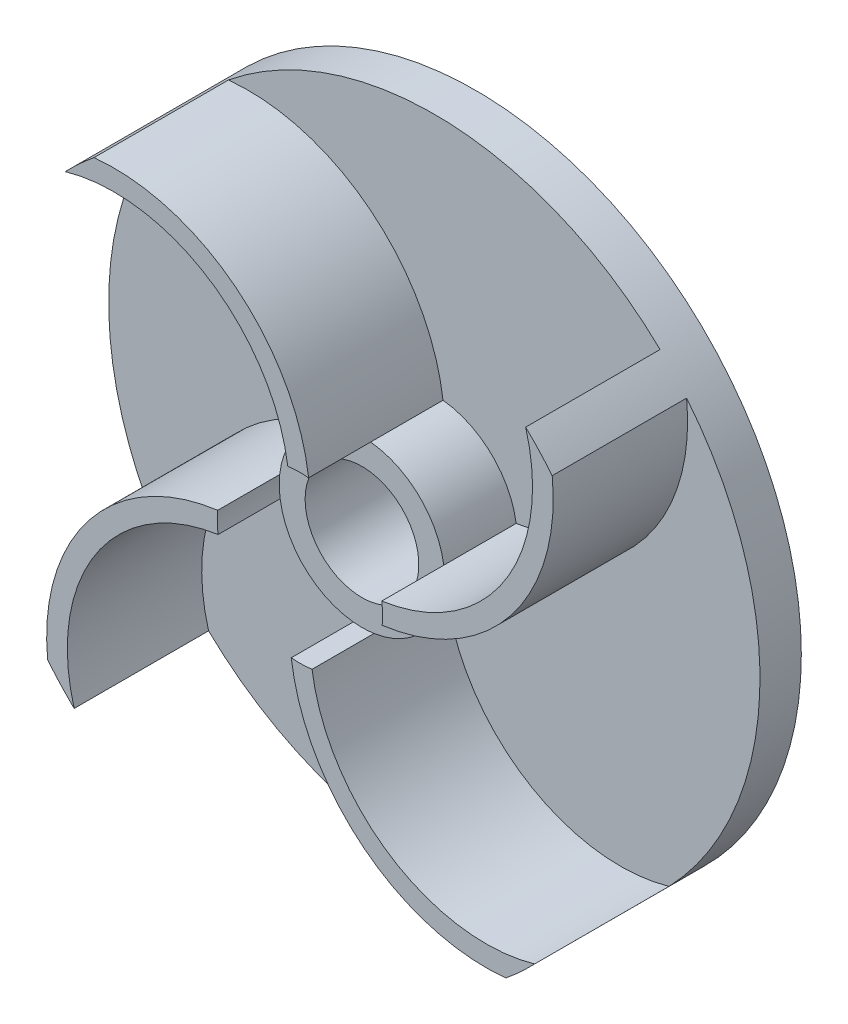
ISO-10303-21;
HEADER;
FILE_DESCRIPTION(('STEP AP214'),'2;1');
FILE_NAME('part.step','',(''),(''),'','','');
FILE_SCHEMA(('AUTOMOTIVE_DESIGN { 1 0 10303 214 1 1 1 1 }'));
ENDSEC;
DATA;
#1=APPLICATION_CONTEXT('core data for automotive mechanical design processes');
#2=APPLICATION_PROTOCOL_DEFINITION('international standard','automotive_design',2000,#1);
#3=PRODUCT_CONTEXT('',#1,'mechanical');
#4=PRODUCT('Part','Part','',(#3));
#5=PRODUCT_RELATED_PRODUCT_CATEGORY('part','',(#4));
#6=PRODUCT_DEFINITION_FORMATION('','',#4);
#7=PRODUCT_DEFINITION_CONTEXT('part definition',#1,'design');
#8=PRODUCT_DEFINITION('design','',#6,#7);
#9=PRODUCT_DEFINITION_SHAPE('','',#8);
#10=(LENGTH_UNIT() NAMED_UNIT(*) SI_UNIT(.MILLI.,.METRE.));
#11=(NAMED_UNIT(*) PLANE_ANGLE_UNIT() SI_UNIT($,.RADIAN.));
#12=(NAMED_UNIT(*) SI_UNIT($,.STERADIAN.) SOLID_ANGLE_UNIT());
#13=UNCERTAINTY_MEASURE_WITH_UNIT(LENGTH_MEASURE(1.E-05),#10,'distance_accuracy_value','');
#14=(GEOMETRIC_REPRESENTATION_CONTEXT(3) GLOBAL_UNCERTAINTY_ASSIGNED_CONTEXT((#13)) GLOBAL_UNIT_ASSIGNED_CONTEXT((#10,
#11,#12)) REPRESENTATION_CONTEXT('',''));
#15=CARTESIAN_POINT('',(0.,0.,0.));
#16=DIRECTION('',(0.,0.,1.));
#17=DIRECTION('',(1.,0.,0.));
#18=AXIS2_PLACEMENT_3D('',#15,#16,#17);
#19=CARTESIAN_POINT('',(0.,0.,4.));
#20=DIRECTION('',(0.,0.,1.));
#21=DIRECTION('',(1.,0.,0.));
#22=AXIS2_PLACEMENT_3D('',#19,#20,#21);
#23=PLANE('',#22);
#24=CARTESIAN_POINT('',(-18.,5.49999999999994,4.));
#25=DIRECTION('',(0.,0.,1.));
#26=DIRECTION('',(0.,1.,0.));
#27=AXIS2_PLACEMENT_3D('',#24,#25,#26);
#28=CIRCLE('',#27,19.);
#29=CARTESIAN_POINT('',(0.840633862767083,7.95571082360145,4.));
#30=VERTEX_POINT('',#29);
#31=CARTESIAN_POINT('',(-19.9185624578197,24.4028865016812,4.));
#32=VERTEX_POINT('',#31);
#33=EDGE_CURVE('E235',#30,#32,#28,.T.);
#34=ORIENTED_EDGE('',*,*,#33,.F.);
#35=CARTESIAN_POINT('',(0.,0.,4.));
#36=DIRECTION('',(0.,0.,1.));
#37=DIRECTION('',(1.,0.,0.));
#38=AXIS2_PLACEMENT_3D('',#35,#36,#37);
#39=CIRCLE('',#38,8.);
#40=CARTESIAN_POINT('',(7.91365321010498,1.17221707469014,4.));
#41=VERTEX_POINT('',#40);
#42=EDGE_CURVE('E352',#41,#30,#39,.T.);
#43=ORIENTED_EDGE('',*,*,#42,.F.);
#44=CARTESIAN_POINT('',(5.5,18.,4.));
#45=DIRECTION('',(0.,0.,-1.));
#46=DIRECTION('',(1.,0.,0.));
#47=AXIS2_PLACEMENT_3D('',#44,#45,#46);
#48=CIRCLE('',#47,17.);
#49=CARTESIAN_POINT('',(21.8366020435947,22.7027049311238,4.));
#50=VERTEX_POINT('',#49);
#51=EDGE_CURVE('E193',#50,#41,#48,.T.);
#52=ORIENTED_EDGE('',*,*,#51,.F.);
#53=CARTESIAN_POINT('',(0.,0.,4.));
#54=DIRECTION('',(0.,0.,1.));
#55=DIRECTION('',(1.,0.,0.));
#56=AXIS2_PLACEMENT_3D('',#53,#54,#55);
#57=CIRCLE('',#56,31.5);
#58=EDGE_CURVE('E267',#50,#32,#57,.T.);
#59=ORIENTED_EDGE('',*,*,#58,.T.);
#60=EDGE_LOOP('',(#34,#43,#52,#59));
#61=FACE_BOUND('',#60,.T.);
#62=ADVANCED_FACE('F27',(#61),#23,.T.);
#63=CARTESIAN_POINT('',(-5.49999999999987,-18.,4.));
#64=DIRECTION('',(0.,0.,1.));
#65=DIRECTION('',(-1.,0.,0.));
#66=AXIS2_PLACEMENT_3D('',#63,#64,#65);
#67=CIRCLE('',#66,19.);
#68=CARTESIAN_POINT('',(-7.95571082360146,0.840633862767053,4.));
#69=VERTEX_POINT('',#68);
#70=CARTESIAN_POINT('',(-24.4028865016812,-19.9185624578198,4.));
#71=VERTEX_POINT('',#70);
#72=EDGE_CURVE('E217',#69,#71,#67,.T.);
#73=ORIENTED_EDGE('',*,*,#72,.F.);
#74=CARTESIAN_POINT('',(-1.17221707469017,7.91365321010498,4.));
#75=VERTEX_POINT('',#74);
#76=EDGE_CURVE('E353',#75,#69,#39,.T.);
#77=ORIENTED_EDGE('',*,*,#76,.F.);
#78=CARTESIAN_POINT('',(-18.,5.49999999999994,4.));
#79=DIRECTION('',(0.,0.,-1.));
#80=DIRECTION('',(0.,1.,0.));
#81=AXIS2_PLACEMENT_3D('',#78,#79,#80);
#82=CIRCLE('',#81,17.);
#83=CARTESIAN_POINT('',(-22.7027049311239,21.8366020435946,4.));
#84=VERTEX_POINT('',#83);
#85=EDGE_CURVE('E237',#84,#75,#82,.T.);
#86=ORIENTED_EDGE('',*,*,#85,.F.);
#87=EDGE_CURVE('E274',#84,#71,#57,.T.);
#88=ORIENTED_EDGE('',*,*,#87,.T.);
#89=EDGE_LOOP('',(#73,#77,#86,#88));
#90=FACE_BOUND('',#89,.T.);
#91=ADVANCED_FACE('F294',(#90),#23,.T.);
#92=CARTESIAN_POINT('',(18.0000000000001,-5.49999999999981,4.));
#93=DIRECTION('',(0.,0.,1.));
#94=DIRECTION('',(0.,-1.,0.));
#95=AXIS2_PLACEMENT_3D('',#92,#93,#94);
#96=CIRCLE('',#95,19.);
#97=CARTESIAN_POINT('',(-0.840633862767022,-7.95571082360146,4.));
#98=VERTEX_POINT('',#97);
#99=CARTESIAN_POINT('',(19.9185624578199,-24.4028865016811,4.));
#100=VERTEX_POINT('',#99);
#101=EDGE_CURVE('E199',#98,#100,#96,.T.);
#102=ORIENTED_EDGE('',*,*,#101,.F.);
#103=CARTESIAN_POINT('',(-7.91365321010497,-1.1722170746902,4.));
#104=VERTEX_POINT('',#103);
#105=EDGE_CURVE('E357',#104,#98,#39,.T.);
#106=ORIENTED_EDGE('',*,*,#105,.F.);
#107=CARTESIAN_POINT('',(-5.49999999999987,-18.,4.));
#108=DIRECTION('',(0.,0.,-1.));
#109=DIRECTION('',(-1.,0.,0.));
#110=AXIS2_PLACEMENT_3D('',#107,#108,#109);
#111=CIRCLE('',#110,17.);
#112=CARTESIAN_POINT('',(-21.8366020435946,-22.702704931124,4.));
#113=VERTEX_POINT('',#112);
#114=EDGE_CURVE('E219',#113,#104,#111,.T.);
#115=ORIENTED_EDGE('',*,*,#114,.F.);
#116=EDGE_CURVE('E277',#113,#100,#57,.T.);
#117=ORIENTED_EDGE('',*,*,#116,.T.);
#118=EDGE_LOOP('',(#102,#106,#115,#117));
#119=FACE_BOUND('',#118,.T.);
#120=ADVANCED_FACE('F385',(#119),#23,.T.);
#121=CARTESIAN_POINT('',(5.5,18.,4.));
#122=DIRECTION('',(0.,0.,1.));
#123=DIRECTION('',(1.,0.,0.));
#124=AXIS2_PLACEMENT_3D('',#121,#122,#123);
#125=CIRCLE('',#124,19.);
#126=CARTESIAN_POINT('',(7.95571082360145,-0.840633862767114,4.));
#127=VERTEX_POINT('',#126);
#128=CARTESIAN_POINT('',(24.4028865016813,19.9185624578196,4.));
#129=VERTEX_POINT('',#128);
#130=EDGE_CURVE('E31',#127,#129,#125,.T.);
#131=ORIENTED_EDGE('',*,*,#130,.F.);
#132=CARTESIAN_POINT('',(1.17221707469023,-7.91365321010497,4.));
#133=VERTEX_POINT('',#132);
#134=EDGE_CURVE('E355',#133,#127,#39,.T.);
#135=ORIENTED_EDGE('',*,*,#134,.F.);
#136=CARTESIAN_POINT('',(18.0000000000001,-5.49999999999981,4.));
#137=DIRECTION('',(0.,0.,-1.));
#138=DIRECTION('',(0.,-1.,0.));
#139=AXIS2_PLACEMENT_3D('',#136,#137,#138);
#140=CIRCLE('',#139,17.);
#141=CARTESIAN_POINT('',(22.7027049311241,-21.8366020435945,4.));
#142=VERTEX_POINT('',#141);
#143=EDGE_CURVE('E201',#142,#133,#140,.T.);
#144=ORIENTED_EDGE('',*,*,#143,.F.);
#145=EDGE_CURVE('E263',#142,#129,#57,.T.);
#146=ORIENTED_EDGE('',*,*,#145,.T.);
#147=EDGE_LOOP('',(#131,#135,#144,#146));
#148=FACE_BOUND('',#147,.T.);
#149=ADVANCED_FACE('F380',(#148),#23,.T.);
#150=CARTESIAN_POINT('',(5.5,18.,17.));
#151=DIRECTION('',(0.,0.,-1.));
#152=DIRECTION('',(-1.,0.,0.));
#153=AXIS2_PLACEMENT_3D('',#150,#151,#152);
#154=CYLINDRICAL_SURFACE('',#153,19.);
#155=DIRECTION('',(0.,0.,1.));
#156=VECTOR('',#155,1.);
#157=CARTESIAN_POINT('',(7.95571082360145,-0.840633862767115,13.5));
#158=LINE('',#157,#156);
#159=CARTESIAN_POINT('',(7.95571082360145,-0.840633862767115,11.));
#160=VERTEX_POINT('',#159);
#161=EDGE_CURVE('E194',#160,#127,#158,.F.);
#162=ORIENTED_EDGE('',*,*,#161,.T.);
#163=ORIENTED_EDGE('',*,*,#130,.T.);
#164=DIRECTION('',(0.,0.,-1.));
#165=VECTOR('',#164,1.);
#166=CARTESIAN_POINT('',(24.4028865016813,19.9185624578196,17.));
#167=LINE('',#166,#165);
#168=CARTESIAN_POINT('',(24.4028865016813,19.9185624578196,17.));
#169=VERTEX_POINT('',#168);
#170=EDGE_CURVE('E264',#169,#129,#167,.T.);
#171=ORIENTED_EDGE('',*,*,#170,.F.);
#172=CARTESIAN_POINT('',(5.5,18.,17.));
#173=DIRECTION('',(0.,0.,1.));
#174=DIRECTION('',(1.,0.,0.));
#175=AXIS2_PLACEMENT_3D('',#172,#173,#174);
#176=CIRCLE('',#175,19.);
#177=CARTESIAN_POINT('',(7.95571082360145,-0.840633862767115,17.));
#178=VERTEX_POINT('',#177);
#179=EDGE_CURVE('E253',#178,#169,#176,.T.);
#180=ORIENTED_EDGE('',*,*,#179,.F.);
#181=EDGE_CURVE('E51',#178,#160,#158,.F.);
#182=ORIENTED_EDGE('',*,*,#181,.T.);
#183=EDGE_LOOP('',(#162,#163,#171,#180,#182));
#184=FACE_BOUND('',#183,.T.);
#185=ADVANCED_FACE('F388',(#184),#154,.T.);
#186=CARTESIAN_POINT('',(5.5,18.,17.));
#187=DIRECTION('',(0.,0.,-1.));
#188=DIRECTION('',(-1.,0.,0.));
#189=AXIS2_PLACEMENT_3D('',#186,#187,#188);
#190=CYLINDRICAL_SURFACE('',#189,17.);
#191=ORIENTED_EDGE('',*,*,#51,.T.);
#192=DIRECTION('',(0.,0.,1.));
#193=VECTOR('',#192,1.);
#194=CARTESIAN_POINT('',(7.91365321010498,1.17221707469014,13.5));
#195=LINE('',#194,#193);
#196=CARTESIAN_POINT('',(7.91365321010498,1.17221707469014,11.));
#197=VERTEX_POINT('',#196);
#198=EDGE_CURVE('E175',#41,#197,#195,.T.);
#199=ORIENTED_EDGE('',*,*,#198,.T.);
#200=CARTESIAN_POINT('',(7.91365321010498,1.17221707469014,17.));
#201=VERTEX_POINT('',#200);
#202=EDGE_CURVE('E182',#197,#201,#195,.T.);
#203=ORIENTED_EDGE('',*,*,#202,.T.);
#204=CARTESIAN_POINT('',(5.5,18.,17.));
#205=DIRECTION('',(0.,0.,-1.));
#206=DIRECTION('',(1.,0.,0.));
#207=AXIS2_PLACEMENT_3D('',#204,#205,#206);
#208=CIRCLE('',#207,17.);
#209=CARTESIAN_POINT('',(21.8366020435947,22.7027049311238,17.));
#210=VERTEX_POINT('',#209);
#211=EDGE_CURVE('E257',#210,#201,#208,.T.);
#212=ORIENTED_EDGE('',*,*,#211,.F.);
#213=DIRECTION('',(0.,0.,-1.));
#214=VECTOR('',#213,1.);
#215=CARTESIAN_POINT('',(21.8366020435947,22.7027049311238,17.));
#216=LINE('',#215,#214);
#217=EDGE_CURVE('E259',#210,#50,#216,.T.);
#218=ORIENTED_EDGE('',*,*,#217,.T.);
#219=EDGE_LOOP('',(#191,#199,#203,#212,#218));
#220=FACE_BOUND('',#219,.T.);
#221=ADVANCED_FACE('F191',(#220),#190,.F.);
#222=CARTESIAN_POINT('',(-18.,5.49999999999994,17.));
#223=DIRECTION('',(0.,0.,-1.));
#224=DIRECTION('',(-1.,0.,0.));
#225=AXIS2_PLACEMENT_3D('',#222,#223,#224);
#226=CYLINDRICAL_SURFACE('',#225,19.);
#227=DIRECTION('',(0.,0.,-1.));
#228=VECTOR('',#227,1.);
#229=CARTESIAN_POINT('',(0.840633862767084,7.95571082360145,7.5));
#230=LINE('',#229,#228);
#231=CARTESIAN_POINT('',(0.840633862767082,7.95571082360145,11.));
#232=VERTEX_POINT('',#231);
#233=EDGE_CURVE('E178',#30,#232,#230,.F.);
#234=ORIENTED_EDGE('',*,*,#233,.F.);
#235=ORIENTED_EDGE('',*,*,#33,.T.);
#236=DIRECTION('',(0.,0.,-1.));
#237=VECTOR('',#236,1.);
#238=CARTESIAN_POINT('',(-19.9185624578197,24.4028865016812,17.));
#239=LINE('',#238,#237);
#240=CARTESIAN_POINT('',(-19.9185624578197,24.4028865016812,17.));
#241=VERTEX_POINT('',#240);
#242=EDGE_CURVE('E249',#241,#32,#239,.T.);
#243=ORIENTED_EDGE('',*,*,#242,.F.);
#244=CARTESIAN_POINT('',(-18.,5.49999999999994,17.));
#245=DIRECTION('',(0.,0.,1.));
#246=DIRECTION('',(0.,1.,0.));
#247=AXIS2_PLACEMENT_3D('',#244,#245,#246);
#248=CIRCLE('',#247,19.);
#249=CARTESIAN_POINT('',(0.840633862767084,7.95571082360146,17.));
#250=VERTEX_POINT('',#249);
#251=EDGE_CURVE('E240',#250,#241,#248,.T.);
#252=ORIENTED_EDGE('',*,*,#251,.F.);
#253=DIRECTION('',(0.,0.,1.));
#254=VECTOR('',#253,1.);
#255=CARTESIAN_POINT('',(0.840633862767084,7.95571082360145,13.5));
#256=LINE('',#255,#254);
#257=EDGE_CURVE('E188',#250,#232,#256,.F.);
#258=ORIENTED_EDGE('',*,*,#257,.T.);
#259=EDGE_LOOP('',(#234,#235,#243,#252,#258));
#260=FACE_BOUND('',#259,.T.);
#261=ADVANCED_FACE('F351',(#260),#226,.T.);
#262=CARTESIAN_POINT('',(-18.,5.49999999999994,17.));
#263=DIRECTION('',(0.,0.,-1.));
#264=DIRECTION('',(-1.,0.,0.));
#265=AXIS2_PLACEMENT_3D('',#262,#263,#264);
#266=CYLINDRICAL_SURFACE('',#265,17.);
#267=ORIENTED_EDGE('',*,*,#85,.T.);
#268=DIRECTION('',(0.,0.,1.));
#269=VECTOR('',#268,1.);
#270=CARTESIAN_POINT('',(-1.17221707469017,7.91365321010498,13.5));
#271=LINE('',#270,#269);
#272=CARTESIAN_POINT('',(-1.17221707469017,7.91365321010498,11.));
#273=VERTEX_POINT('',#272);
#274=EDGE_CURVE('E333',#75,#273,#271,.T.);
#275=ORIENTED_EDGE('',*,*,#274,.T.);
#276=CARTESIAN_POINT('',(-1.17221707469017,7.91365321010498,17.));
#277=VERTEX_POINT('',#276);
#278=EDGE_CURVE('E332',#273,#277,#271,.T.);
#279=ORIENTED_EDGE('',*,*,#278,.T.);
#280=CARTESIAN_POINT('',(-18.,5.49999999999994,17.));
#281=DIRECTION('',(0.,0.,-1.));
#282=DIRECTION('',(0.,1.,0.));
#283=AXIS2_PLACEMENT_3D('',#280,#281,#282);
#284=CIRCLE('',#283,17.);
#285=CARTESIAN_POINT('',(-22.7027049311239,21.8366020435946,17.));
#286=VERTEX_POINT('',#285);
#287=EDGE_CURVE('E244',#286,#277,#284,.T.);
#288=ORIENTED_EDGE('',*,*,#287,.F.);
#289=DIRECTION('',(0.,0.,-1.));
#290=VECTOR('',#289,1.);
#291=CARTESIAN_POINT('',(-22.7027049311239,21.8366020435946,17.));
#292=LINE('',#291,#290);
#293=EDGE_CURVE('E247',#286,#84,#292,.T.);
#294=ORIENTED_EDGE('',*,*,#293,.T.);
#295=EDGE_LOOP('',(#267,#275,#279,#288,#294));
#296=FACE_BOUND('',#295,.T.);
#297=ADVANCED_FACE('F340',(#296),#266,.F.);
#298=CARTESIAN_POINT('',(-5.49999999999987,-18.,17.));
#299=DIRECTION('',(0.,0.,-1.));
#300=DIRECTION('',(-1.,0.,0.));
#301=AXIS2_PLACEMENT_3D('',#298,#299,#300);
#302=CYLINDRICAL_SURFACE('',#301,19.);
#303=DIRECTION('',(0.,0.,-1.));
#304=VECTOR('',#303,1.);
#305=CARTESIAN_POINT('',(-7.95571082360146,0.840633862767053,7.5));
#306=LINE('',#305,#304);
#307=CARTESIAN_POINT('',(-7.95571082360146,0.840633862767054,11.));
#308=VERTEX_POINT('',#307);
#309=EDGE_CURVE('E307',#69,#308,#306,.F.);
#310=ORIENTED_EDGE('',*,*,#309,.F.);
#311=ORIENTED_EDGE('',*,*,#72,.T.);
#312=DIRECTION('',(0.,0.,-1.));
#313=VECTOR('',#312,1.);
#314=CARTESIAN_POINT('',(-24.4028865016812,-19.9185624578198,17.));
#315=LINE('',#314,#313);
#316=CARTESIAN_POINT('',(-24.4028865016812,-19.9185624578198,17.));
#317=VERTEX_POINT('',#316);
#318=EDGE_CURVE('E232',#317,#71,#315,.T.);
#319=ORIENTED_EDGE('',*,*,#318,.F.);
#320=CARTESIAN_POINT('',(-5.49999999999987,-18.,17.));
#321=DIRECTION('',(0.,0.,1.));
#322=DIRECTION('',(-1.,0.,0.));
#323=AXIS2_PLACEMENT_3D('',#320,#321,#322);
#324=CIRCLE('',#323,19.);
#325=CARTESIAN_POINT('',(-7.95571082360146,0.840633862767053,17.));
#326=VERTEX_POINT('',#325);
#327=EDGE_CURVE('E222',#326,#317,#324,.T.);
#328=ORIENTED_EDGE('',*,*,#327,.F.);
#329=DIRECTION('',(0.,0.,1.));
#330=VECTOR('',#329,1.);
#331=CARTESIAN_POINT('',(-7.95571082360146,0.840633862767053,13.5));
#332=LINE('',#331,#330);
#333=EDGE_CURVE('E308',#326,#308,#332,.F.);
#334=ORIENTED_EDGE('',*,*,#333,.T.);
#335=EDGE_LOOP('',(#310,#311,#319,#328,#334));
#336=FACE_BOUND('',#335,.T.);
#337=ADVANCED_FACE('F305',(#336),#302,.T.);
#338=CARTESIAN_POINT('',(-5.49999999999987,-18.,17.));
#339=DIRECTION('',(0.,0.,-1.));
#340=DIRECTION('',(-1.,0.,0.));
#341=AXIS2_PLACEMENT_3D('',#338,#339,#340);
#342=CYLINDRICAL_SURFACE('',#341,17.);
#343=ORIENTED_EDGE('',*,*,#114,.T.);
#344=DIRECTION('',(0.,0.,1.));
#345=VECTOR('',#344,1.);
#346=CARTESIAN_POINT('',(-7.91365321010497,-1.1722170746902,13.5));
#347=LINE('',#346,#345);
#348=CARTESIAN_POINT('',(-7.91365321010497,-1.1722170746902,11.));
#349=VERTEX_POINT('',#348);
#350=EDGE_CURVE('E329',#104,#349,#347,.T.);
#351=ORIENTED_EDGE('',*,*,#350,.T.);
#352=CARTESIAN_POINT('',(-7.91365321010497,-1.1722170746902,17.));
#353=VERTEX_POINT('',#352);
#354=EDGE_CURVE('E328',#349,#353,#347,.T.);
#355=ORIENTED_EDGE('',*,*,#354,.T.);
#356=CARTESIAN_POINT('',(-5.49999999999987,-18.,17.));
#357=DIRECTION('',(0.,0.,-1.));
#358=DIRECTION('',(-1.,0.,0.));
#359=AXIS2_PLACEMENT_3D('',#356,#357,#358);
#360=CIRCLE('',#359,17.);
#361=CARTESIAN_POINT('',(-21.8366020435946,-22.702704931124,17.));
#362=VERTEX_POINT('',#361);
#363=EDGE_CURVE('E226',#362,#353,#360,.T.);
#364=ORIENTED_EDGE('',*,*,#363,.F.);
#365=DIRECTION('',(0.,0.,-1.));
#366=VECTOR('',#365,1.);
#367=CARTESIAN_POINT('',(-21.8366020435946,-22.702704931124,17.));
#368=LINE('',#367,#366);
#369=EDGE_CURVE('E229',#362,#113,#368,.T.);
#370=ORIENTED_EDGE('',*,*,#369,.T.);
#371=EDGE_LOOP('',(#343,#351,#355,#364,#370));
#372=FACE_BOUND('',#371,.T.);
#373=ADVANCED_FACE('F435',(#372),#342,.F.);
#374=CARTESIAN_POINT('',(18.0000000000001,-5.49999999999981,17.));
#375=DIRECTION('',(0.,0.,-1.));
#376=DIRECTION('',(-1.,0.,0.));
#377=AXIS2_PLACEMENT_3D('',#374,#375,#376);
#378=CYLINDRICAL_SURFACE('',#377,19.);
#379=DIRECTION('',(0.,0.,-1.));
#380=VECTOR('',#379,1.);
#381=CARTESIAN_POINT('',(-0.840633862767025,-7.95571082360146,7.5));
#382=LINE('',#381,#380);
#383=CARTESIAN_POINT('',(-0.840633862767025,-7.95571082360146,11.));
#384=VERTEX_POINT('',#383);
#385=EDGE_CURVE('E179',#98,#384,#382,.F.);
#386=ORIENTED_EDGE('',*,*,#385,.F.);
#387=ORIENTED_EDGE('',*,*,#101,.T.);
#388=DIRECTION('',(0.,0.,-1.));
#389=VECTOR('',#388,1.);
#390=CARTESIAN_POINT('',(19.9185624578199,-24.4028865016811,17.));
#391=LINE('',#390,#389);
#392=CARTESIAN_POINT('',(19.9185624578199,-24.4028865016811,17.));
#393=VERTEX_POINT('',#392);
#394=EDGE_CURVE('E214',#393,#100,#391,.T.);
#395=ORIENTED_EDGE('',*,*,#394,.F.);
#396=CARTESIAN_POINT('',(18.0000000000001,-5.49999999999981,17.));
#397=DIRECTION('',(0.,0.,1.));
#398=DIRECTION('',(0.,-1.,0.));
#399=AXIS2_PLACEMENT_3D('',#396,#397,#398);
#400=CIRCLE('',#399,19.);
#401=CARTESIAN_POINT('',(-0.840633862767025,-7.95571082360146,17.));
#402=VERTEX_POINT('',#401);
#403=EDGE_CURVE('E204',#402,#393,#400,.T.);
#404=ORIENTED_EDGE('',*,*,#403,.F.);
#405=DIRECTION('',(0.,0.,1.));
#406=VECTOR('',#405,1.);
#407=CARTESIAN_POINT('',(-0.840633862767025,-7.95571082360146,13.5));
#408=LINE('',#407,#406);
#409=EDGE_CURVE('E324',#402,#384,#408,.F.);
#410=ORIENTED_EDGE('',*,*,#409,.T.);
#411=EDGE_LOOP('',(#386,#387,#395,#404,#410));
#412=FACE_BOUND('',#411,.T.);
#413=ADVANCED_FACE('F440',(#412),#378,.T.);
#414=CARTESIAN_POINT('',(18.0000000000001,-5.49999999999981,17.));
#415=DIRECTION('',(0.,0.,-1.));
#416=DIRECTION('',(-1.,0.,0.));
#417=AXIS2_PLACEMENT_3D('',#414,#415,#416);
#418=CYLINDRICAL_SURFACE('',#417,17.);
#419=ORIENTED_EDGE('',*,*,#143,.T.);
#420=DIRECTION('',(0.,0.,1.));
#421=VECTOR('',#420,1.);
#422=CARTESIAN_POINT('',(1.17221707469023,-7.91365321010497,13.5));
#423=LINE('',#422,#421);
#424=CARTESIAN_POINT('',(1.17221707469023,-7.91365321010497,11.));
#425=VERTEX_POINT('',#424);
#426=EDGE_CURVE('E321',#133,#425,#423,.T.);
#427=ORIENTED_EDGE('',*,*,#426,.T.);
#428=CARTESIAN_POINT('',(1.17221707469023,-7.91365321010497,17.));
#429=VERTEX_POINT('',#428);
#430=EDGE_CURVE('E325',#425,#429,#423,.T.);
#431=ORIENTED_EDGE('',*,*,#430,.T.);
#432=CARTESIAN_POINT('',(18.0000000000001,-5.49999999999981,17.));
#433=DIRECTION('',(0.,0.,-1.));
#434=DIRECTION('',(0.,-1.,0.));
#435=AXIS2_PLACEMENT_3D('',#432,#433,#434);
#436=CIRCLE('',#435,17.);
#437=CARTESIAN_POINT('',(22.7027049311241,-21.8366020435945,17.));
#438=VERTEX_POINT('',#437);
#439=EDGE_CURVE('E208',#438,#429,#436,.T.);
#440=ORIENTED_EDGE('',*,*,#439,.F.);
#441=DIRECTION('',(0.,0.,-1.));
#442=VECTOR('',#441,1.);
#443=CARTESIAN_POINT('',(22.7027049311241,-21.8366020435945,17.));
#444=LINE('',#443,#442);
#445=EDGE_CURVE('E211',#438,#142,#444,.T.);
#446=ORIENTED_EDGE('',*,*,#445,.T.);
#447=EDGE_LOOP('',(#419,#427,#431,#440,#446));
#448=FACE_BOUND('',#447,.T.);
#449=ADVANCED_FACE('F448',(#448),#418,.F.);
#450=CARTESIAN_POINT('',(0.,0.,17.));
#451=DIRECTION('',(0.,0.,-1.));
#452=DIRECTION('',(-1.,0.,0.));
#453=AXIS2_PLACEMENT_3D('',#450,#451,#452);
#454=CYLINDRICAL_SURFACE('',#453,5.5);
#455=CARTESIAN_POINT('',(0.,0.,11.));
#456=DIRECTION('',(0.,0.,1.));
#457=DIRECTION('',(1.,0.,0.));
#458=AXIS2_PLACEMENT_3D('',#455,#456,#457);
#459=CIRCLE('',#458,5.5);
#460=CARTESIAN_POINT('',(-5.5,0.,11.));
#461=VERTEX_POINT('',#460);
#462=EDGE_CURVE('E360',#461,#461,#459,.T.);
#463=CARTESIAN_POINT('',(0.,0.,0.));
#464=DIRECTION('',(0.,0.,1.));
#465=DIRECTION('',(1.,0.,0.));
#466=AXIS2_PLACEMENT_3D('',#463,#464,#465);
#467=CIRCLE('',#466,5.5);
#468=CARTESIAN_POINT('',(-5.5,0.,0.));
#469=VERTEX_POINT('',#468);
#470=EDGE_CURVE('E312',#469,#469,#467,.T.);
#471=CARTESIAN_POINT('',(-5.5,0.,11.));
#472=CARTESIAN_POINT('',(-5.5,0.,10.8854166666667));
#473=CARTESIAN_POINT('',(-5.5,0.,10.7708333333333));
#474=CARTESIAN_POINT('',(-5.5,0.,10.5416666666667));
#475=CARTESIAN_POINT('',(-5.5,0.,10.4270833333333));
#476=CARTESIAN_POINT('',(-5.5,0.,10.1979166666667));
#477=CARTESIAN_POINT('',(-5.5,0.,10.0833333333333));
#478=CARTESIAN_POINT('',(-5.5,0.,9.85416666666667));
#479=CARTESIAN_POINT('',(-5.5,0.,9.73958333333333));
#480=CARTESIAN_POINT('',(-5.5,0.,9.51041666666667));
#481=CARTESIAN_POINT('',(-5.5,0.,9.39583333333333));
#482=CARTESIAN_POINT('',(-5.5,0.,9.16666666666666));
#483=CARTESIAN_POINT('',(-5.5,0.,9.05208333333333));
#484=CARTESIAN_POINT('',(-5.5,0.,8.82291666666667));
#485=CARTESIAN_POINT('',(-5.5,0.,8.70833333333333));
#486=CARTESIAN_POINT('',(-5.5,0.,8.47916666666667));
#487=CARTESIAN_POINT('',(-5.5,0.,8.36458333333333));
#488=CARTESIAN_POINT('',(-5.5,0.,8.13541666666667));
#489=CARTESIAN_POINT('',(-5.5,0.,8.02083333333333));
#490=CARTESIAN_POINT('',(-5.5,0.,7.79166666666666));
#491=CARTESIAN_POINT('',(-5.5,0.,7.67708333333333));
#492=CARTESIAN_POINT('',(-5.5,0.,7.44791666666666));
#493=CARTESIAN_POINT('',(-5.5,0.,7.33333333333333));
#494=CARTESIAN_POINT('',(-5.5,0.,7.10416666666666));
#495=CARTESIAN_POINT('',(-5.5,0.,6.98958333333333));
#496=CARTESIAN_POINT('',(-5.5,0.,6.76041666666666));
#497=CARTESIAN_POINT('',(-5.5,0.,6.64583333333333));
#498=CARTESIAN_POINT('',(-5.5,0.,6.41666666666666));
#499=CARTESIAN_POINT('',(-5.5,0.,6.30208333333333));
#500=CARTESIAN_POINT('',(-5.5,0.,6.07291666666666));
#501=CARTESIAN_POINT('',(-5.5,0.,5.95833333333333));
#502=CARTESIAN_POINT('',(-5.5,0.,5.72916666666666));
#503=CARTESIAN_POINT('',(-5.5,0.,5.61458333333333));
#504=CARTESIAN_POINT('',(-5.5,0.,5.38541666666666));
#505=CARTESIAN_POINT('',(-5.5,0.,5.27083333333333));
#506=CARTESIAN_POINT('',(-5.5,0.,5.04166666666666));
#507=CARTESIAN_POINT('',(-5.5,0.,4.92708333333333));
#508=CARTESIAN_POINT('',(-5.5,0.,4.69791666666666));
#509=CARTESIAN_POINT('',(-5.5,0.,4.58333333333333));
#510=CARTESIAN_POINT('',(-5.5,0.,4.35416666666666));
#511=CARTESIAN_POINT('',(-5.5,0.,4.23958333333333));
#512=CARTESIAN_POINT('',(-5.5,0.,4.01041666666666));
#513=CARTESIAN_POINT('',(-5.5,0.,3.89583333333333));
#514=CARTESIAN_POINT('',(-5.5,0.,3.66666666666666));
#515=CARTESIAN_POINT('',(-5.5,0.,3.55208333333333));
#516=CARTESIAN_POINT('',(-5.5,0.,3.32291666666666));
#517=CARTESIAN_POINT('',(-5.5,0.,3.20833333333333));
#518=CARTESIAN_POINT('',(-5.5,0.,2.97916666666666));
#519=CARTESIAN_POINT('',(-5.5,0.,2.86458333333333));
#520=CARTESIAN_POINT('',(-5.5,0.,2.63541666666666));
#521=CARTESIAN_POINT('',(-5.5,0.,2.52083333333333));
#522=CARTESIAN_POINT('',(-5.5,0.,2.29166666666666));
#523=CARTESIAN_POINT('',(-5.5,0.,2.17708333333333));
#524=CARTESIAN_POINT('',(-5.5,0.,1.94791666666666));
#525=CARTESIAN_POINT('',(-5.5,0.,1.83333333333333));
#526=CARTESIAN_POINT('',(-5.5,0.,1.60416666666666));
#527=CARTESIAN_POINT('',(-5.5,0.,1.48958333333333));
#528=CARTESIAN_POINT('',(-5.5,0.,1.26041666666666));
#529=CARTESIAN_POINT('',(-5.5,0.,1.14583333333333));
#530=CARTESIAN_POINT('',(-5.5,0.,0.916666666666664));
#531=CARTESIAN_POINT('',(-5.5,0.,0.802083333333331));
#532=CARTESIAN_POINT('',(-5.5,0.,0.572916666666664));
#533=CARTESIAN_POINT('',(-5.5,0.,0.45833333333333));
#534=CARTESIAN_POINT('',(-5.5,0.,0.229166666666663));
#535=CARTESIAN_POINT('',(-5.5,0.,0.11458333333333));
#536=CARTESIAN_POINT('',(-5.5,0.,0.));
#537=B_SPLINE_CURVE_WITH_KNOTS('',3,(#471,#472,#473,#474,#475,#476,#477,#478,#479,#480,#481,
#482,#483,#484,#485,#486,#487,#488,#489,#490,#491,#492,#493,#494,#495,#496,#497,#498,#499,#500,
#501,#502,#503,#504,#505,#506,#507,#508,#509,#510,#511,#512,#513,#514,#515,#516,#517,#518,#519,
#520,#521,#522,#523,#524,#525,#526,#527,#528,#529,#530,#531,#532,#533,#534,#535,#536),
.UNSPECIFIED.,.F.,.F.,(4,2,2,2,2,2,2,2,2,2,2,2,2,2,2,2,2,2,2,2,2,2,2,2,2,2,2,2,2,2,2,2,4),(0.,
0.34375,0.687500000000001,1.03125,1.375,1.71875,2.0625,2.40625,2.75,3.09375,3.4375,3.78125,
4.125,4.46875,4.8125,5.15625,5.5,5.84375,6.1875,6.53125,6.875,7.21875,7.5625,7.90625,8.25,
8.59375,8.93750000000001,9.28125,9.625,9.96875,10.3125,10.65625,11.),.UNSPECIFIED.);
#538=EDGE_CURVE('BSEAM367',#461,#469,#537,.T.);
#539=ORIENTED_EDGE('',*,*,#462,.T.);
#540=ORIENTED_EDGE('',*,*,#470,.F.);
#541=ORIENTED_EDGE('',*,*,#538,.T.);
#542=ORIENTED_EDGE('',*,*,#538,.F.);
#543=EDGE_LOOP('',(#539,#541,#540,#542));
#544=FACE_BOUND('',#543,.T.);
#545=ADVANCED_FACE('F367',(#544),#454,.F.);
#546=CARTESIAN_POINT('',(0.,0.,4.));
#547=DIRECTION('',(0.,0.,-1.));
#548=DIRECTION('',(-1.,0.,0.));
#549=AXIS2_PLACEMENT_3D('',#546,#547,#548);
#550=CYLINDRICAL_SURFACE('',#549,31.5);
#551=ORIENTED_EDGE('',*,*,#58,.F.);
#552=ORIENTED_EDGE('',*,*,#217,.F.);
#553=CARTESIAN_POINT('',(0.,0.,17.));
#554=DIRECTION('',(0.,0.,1.));
#555=DIRECTION('',(1.,0.,0.));
#556=AXIS2_PLACEMENT_3D('',#553,#554,#555);
#557=CIRCLE('',#556,31.5);
#558=EDGE_CURVE('E255',#169,#210,#557,.T.);
#559=ORIENTED_EDGE('',*,*,#558,.F.);
#560=ORIENTED_EDGE('',*,*,#170,.T.);
#561=ORIENTED_EDGE('',*,*,#145,.F.);
#562=ORIENTED_EDGE('',*,*,#445,.F.);
#563=CARTESIAN_POINT('',(0.,0.,17.));
#564=DIRECTION('',(0.,0.,1.));
#565=DIRECTION('',(0.,-1.,0.));
#566=AXIS2_PLACEMENT_3D('',#563,#564,#565);
#567=CIRCLE('',#566,31.5);
#568=EDGE_CURVE('E206',#393,#438,#567,.T.);
#569=ORIENTED_EDGE('',*,*,#568,.F.);
#570=ORIENTED_EDGE('',*,*,#394,.T.);
#571=ORIENTED_EDGE('',*,*,#116,.F.);
#572=ORIENTED_EDGE('',*,*,#369,.F.);
#573=CARTESIAN_POINT('',(0.,0.,17.));
#574=DIRECTION('',(0.,0.,1.));
#575=DIRECTION('',(-1.,0.,0.));
#576=AXIS2_PLACEMENT_3D('',#573,#574,#575);
#577=CIRCLE('',#576,31.5);
#578=EDGE_CURVE('E224',#317,#362,#577,.T.);
#579=ORIENTED_EDGE('',*,*,#578,.F.);
#580=ORIENTED_EDGE('',*,*,#318,.T.);
#581=ORIENTED_EDGE('',*,*,#87,.F.);
#582=ORIENTED_EDGE('',*,*,#293,.F.);
#583=CARTESIAN_POINT('',(0.,0.,17.));
#584=DIRECTION('',(0.,0.,1.));
#585=DIRECTION('',(0.,1.,0.));
#586=AXIS2_PLACEMENT_3D('',#583,#584,#585);
#587=CIRCLE('',#586,31.5);
#588=EDGE_CURVE('E242',#241,#286,#587,.T.);
#589=ORIENTED_EDGE('',*,*,#588,.F.);
#590=ORIENTED_EDGE('',*,*,#242,.T.);
#591=EDGE_LOOP('',(#551,#552,#559,#560,#561,#562,#569,#570,#571,#572,#579,#580,#581,#582,#589,#590));
#592=FACE_BOUND('',#591,.T.);
#593=CARTESIAN_POINT('',(0.,0.,0.));
#594=DIRECTION('',(0.,0.,1.));
#595=DIRECTION('',(1.,0.,0.));
#596=AXIS2_PLACEMENT_3D('',#593,#594,#595);
#597=CIRCLE('',#596,31.5);
#598=CARTESIAN_POINT('',(31.5,0.,0.));
#599=VERTEX_POINT('',#598);
#600=EDGE_CURVE('E260',#599,#599,#597,.T.);
#601=ORIENTED_EDGE('',*,*,#600,.T.);
#602=EDGE_LOOP('',(#601));
#603=FACE_BOUND('',#602,.T.);
#604=ADVANCED_FACE('F29',(#592,#603),#550,.T.);
#605=CARTESIAN_POINT('',(0.,0.,0.));
#606=DIRECTION('',(0.,0.,1.));
#607=DIRECTION('',(1.,0.,0.));
#608=AXIS2_PLACEMENT_3D('',#605,#606,#607);
#609=PLANE('',#608);
#610=ORIENTED_EDGE('',*,*,#470,.T.);
#611=EDGE_LOOP('',(#610));
#612=FACE_BOUND('',#611,.T.);
#613=ORIENTED_EDGE('',*,*,#600,.F.);
#614=EDGE_LOOP('',(#613));
#615=FACE_BOUND('',#614,.T.);
#616=ADVANCED_FACE('F413',(#612,#615),#609,.F.);
#617=CARTESIAN_POINT('',(2.75,9.,17.));
#618=DIRECTION('',(0.,0.,1.));
#619=DIRECTION('',(1.,0.,0.));
#620=AXIS2_PLACEMENT_3D('',#617,#618,#619);
#621=PLANE('',#620);
#622=CARTESIAN_POINT('',(0.,0.,17.));
#623=DIRECTION('',(0.,0.,1.));
#624=DIRECTION('',(1.,0.,0.));
#625=AXIS2_PLACEMENT_3D('',#622,#623,#624);
#626=CIRCLE('',#625,8.);
#627=EDGE_CURVE('E184',#178,#201,#626,.T.);
#628=ORIENTED_EDGE('',*,*,#627,.F.);
#629=ORIENTED_EDGE('',*,*,#179,.T.);
#630=ORIENTED_EDGE('',*,*,#558,.T.);
#631=ORIENTED_EDGE('',*,*,#211,.T.);
#632=EDGE_LOOP('',(#628,#629,#630,#631));
#633=FACE_BOUND('',#632,.T.);
#634=ADVANCED_FACE('F411',(#633),#621,.T.);
#635=CARTESIAN_POINT('',(-9.00000000000001,2.74999999999997,17.));
#636=DIRECTION('',(0.,0.,1.));
#637=DIRECTION('',(0.,1.,0.));
#638=AXIS2_PLACEMENT_3D('',#635,#636,#637);
#639=PLANE('',#638);
#640=EDGE_CURVE('E320',#250,#277,#626,.T.);
#641=ORIENTED_EDGE('',*,*,#640,.F.);
#642=ORIENTED_EDGE('',*,*,#251,.T.);
#643=ORIENTED_EDGE('',*,*,#588,.T.);
#644=ORIENTED_EDGE('',*,*,#287,.T.);
#645=EDGE_LOOP('',(#641,#642,#643,#644));
#646=FACE_BOUND('',#645,.T.);
#647=ADVANCED_FACE('F346',(#646),#639,.T.);
#648=CARTESIAN_POINT('',(-2.74999999999994,-9.00000000000002,17.));
#649=DIRECTION('',(0.,0.,1.));
#650=DIRECTION('',(-1.,0.,0.));
#651=AXIS2_PLACEMENT_3D('',#648,#649,#650);
#652=PLANE('',#651);
#653=EDGE_CURVE('E319',#326,#353,#626,.T.);
#654=ORIENTED_EDGE('',*,*,#653,.F.);
#655=ORIENTED_EDGE('',*,*,#327,.T.);
#656=ORIENTED_EDGE('',*,*,#578,.T.);
#657=ORIENTED_EDGE('',*,*,#363,.T.);
#658=EDGE_LOOP('',(#654,#655,#656,#657));
#659=FACE_BOUND('',#658,.T.);
#660=ADVANCED_FACE('F419',(#659),#652,.T.);
#661=CARTESIAN_POINT('',(9.00000000000003,-2.74999999999991,17.));
#662=DIRECTION('',(0.,0.,1.));
#663=DIRECTION('',(0.,-1.,0.));
#664=AXIS2_PLACEMENT_3D('',#661,#662,#663);
#665=PLANE('',#664);
#666=CARTESIAN_POINT('',(0.,0.,17.));
#667=DIRECTION('',(0.,0.,1.));
#668=DIRECTION('',(1.,0.,0.));
#669=AXIS2_PLACEMENT_3D('',#666,#667,#668);
#670=CIRCLE('',#669,8.);
#671=EDGE_CURVE('E37',#402,#429,#670,.T.);
#672=ORIENTED_EDGE('',*,*,#671,.F.);
#673=ORIENTED_EDGE('',*,*,#403,.T.);
#674=ORIENTED_EDGE('',*,*,#568,.T.);
#675=ORIENTED_EDGE('',*,*,#439,.T.);
#676=EDGE_LOOP('',(#672,#673,#674,#675));
#677=FACE_BOUND('',#676,.T.);
#678=ADVANCED_FACE('F444',(#677),#665,.T.);
#679=CARTESIAN_POINT('',(0.,0.,10.));
#680=DIRECTION('',(0.,0.,1.));
#681=DIRECTION('',(1.,0.,0.));
#682=AXIS2_PLACEMENT_3D('',#679,#680,#681);
#683=CYLINDRICAL_SURFACE('',#682,8.);
#684=ORIENTED_EDGE('',*,*,#430,.F.);
#685=CARTESIAN_POINT('',(0.,0.,11.));
#686=DIRECTION('',(0.,0.,1.));
#687=DIRECTION('',(1.,0.,0.));
#688=AXIS2_PLACEMENT_3D('',#685,#686,#687);
#689=CIRCLE('',#688,8.);
#690=EDGE_CURVE('E356',#384,#425,#689,.T.);
#691=ORIENTED_EDGE('',*,*,#690,.F.);
#692=ORIENTED_EDGE('',*,*,#409,.F.);
#693=ORIENTED_EDGE('',*,*,#671,.T.);
#694=EDGE_LOOP('',(#684,#691,#692,#693));
#695=FACE_BOUND('',#694,.T.);
#696=ADVANCED_FACE('F457',(#695),#683,.F.);
#697=ORIENTED_EDGE('',*,*,#354,.F.);
#698=EDGE_CURVE('E472',#308,#349,#689,.T.);
#699=ORIENTED_EDGE('',*,*,#698,.F.);
#700=ORIENTED_EDGE('',*,*,#333,.F.);
#701=ORIENTED_EDGE('',*,*,#653,.T.);
#702=EDGE_LOOP('',(#697,#699,#700,#701));
#703=FACE_BOUND('',#702,.T.);
#704=ADVANCED_FACE('F489',(#703),#683,.F.);
#705=ORIENTED_EDGE('',*,*,#278,.F.);
#706=EDGE_CURVE('E180',#232,#273,#689,.T.);
#707=ORIENTED_EDGE('',*,*,#706,.F.);
#708=ORIENTED_EDGE('',*,*,#257,.F.);
#709=ORIENTED_EDGE('',*,*,#640,.T.);
#710=EDGE_LOOP('',(#705,#707,#708,#709));
#711=FACE_BOUND('',#710,.T.);
#712=ADVANCED_FACE('F343',(#711),#683,.F.);
#713=ORIENTED_EDGE('',*,*,#202,.F.);
#714=CARTESIAN_POINT('',(0.,0.,11.));
#715=DIRECTION('',(0.,0.,1.));
#716=DIRECTION('',(1.,0.,0.));
#717=AXIS2_PLACEMENT_3D('',#714,#715,#716);
#718=CIRCLE('',#717,8.);
#719=EDGE_CURVE('E11',#197,#160,#718,.F.);
#720=ORIENTED_EDGE('',*,*,#719,.T.);
#721=ORIENTED_EDGE('',*,*,#181,.F.);
#722=ORIENTED_EDGE('',*,*,#627,.T.);
#723=EDGE_LOOP('',(#713,#720,#721,#722));
#724=FACE_BOUND('',#723,.T.);
#725=ADVANCED_FACE('F183',(#724),#683,.F.);
#726=CARTESIAN_POINT('',(0.,0.,11.));
#727=DIRECTION('',(0.,0.,-1.));
#728=DIRECTION('',(-1.,0.,0.));
#729=AXIS2_PLACEMENT_3D('',#726,#727,#728);
#730=CYLINDRICAL_SURFACE('',#729,8.);
#731=ORIENTED_EDGE('',*,*,#134,.T.);
#732=ORIENTED_EDGE('',*,*,#161,.F.);
#733=EDGE_CURVE('E44',#425,#160,#689,.T.);
#734=ORIENTED_EDGE('',*,*,#733,.F.);
#735=ORIENTED_EDGE('',*,*,#426,.F.);
#736=EDGE_LOOP('',(#731,#732,#734,#735));
#737=FACE_BOUND('',#736,.T.);
#738=ADVANCED_FACE('F378',(#737),#730,.T.);
#739=EDGE_CURVE('E169',#197,#232,#689,.T.);
#740=ORIENTED_EDGE('',*,*,#739,.F.);
#741=ORIENTED_EDGE('',*,*,#198,.F.);
#742=ORIENTED_EDGE('',*,*,#42,.T.);
#743=ORIENTED_EDGE('',*,*,#233,.T.);
#744=EDGE_LOOP('',(#740,#741,#742,#743));
#745=FACE_BOUND('',#744,.T.);
#746=ADVANCED_FACE('F173',(#745),#730,.T.);
#747=EDGE_CURVE('E469',#273,#308,#689,.T.);
#748=ORIENTED_EDGE('',*,*,#747,.F.);
#749=ORIENTED_EDGE('',*,*,#274,.F.);
#750=ORIENTED_EDGE('',*,*,#76,.T.);
#751=ORIENTED_EDGE('',*,*,#309,.T.);
#752=EDGE_LOOP('',(#748,#749,#750,#751));
#753=FACE_BOUND('',#752,.T.);
#754=ADVANCED_FACE('F375',(#753),#730,.T.);
#755=EDGE_CURVE('E473',#349,#384,#689,.T.);
#756=ORIENTED_EDGE('',*,*,#755,.F.);
#757=ORIENTED_EDGE('',*,*,#350,.F.);
#758=ORIENTED_EDGE('',*,*,#105,.T.);
#759=ORIENTED_EDGE('',*,*,#385,.T.);
#760=EDGE_LOOP('',(#756,#757,#758,#759));
#761=FACE_BOUND('',#760,.T.);
#762=ADVANCED_FACE('F370',(#761),#730,.T.);
#763=CARTESIAN_POINT('',(0.,0.,11.));
#764=DIRECTION('',(0.,0.,1.));
#765=DIRECTION('',(1.,0.,0.));
#766=AXIS2_PLACEMENT_3D('',#763,#764,#765);
#767=PLANE('',#766);
#768=ORIENTED_EDGE('',*,*,#739,.T.);
#769=ORIENTED_EDGE('',*,*,#706,.T.);
#770=ORIENTED_EDGE('',*,*,#747,.T.);
#771=ORIENTED_EDGE('',*,*,#698,.T.);
#772=ORIENTED_EDGE('',*,*,#755,.T.);
#773=ORIENTED_EDGE('',*,*,#690,.T.);
#774=ORIENTED_EDGE('',*,*,#733,.T.);
#775=ORIENTED_EDGE('',*,*,#719,.F.);
#776=EDGE_LOOP('',(#768,#769,#770,#771,#772,#773,#774,#775));
#777=FACE_BOUND('',#776,.T.);
#778=ORIENTED_EDGE('',*,*,#462,.F.);
#779=EDGE_LOOP('',(#778));
#780=FACE_BOUND('',#779,.T.);
#781=ADVANCED_FACE('F166',(#777,#780),#767,.T.);
#782=CLOSED_SHELL('',(#62,#91,#120,#149,#185,#221,#261,#297,#337,#373,#413,#449,#545,#604,#616,
#634,#647,#660,#678,#696,#704,#712,#725,#738,#746,#754,#762,#781));
#783=MANIFOLD_SOLID_BREP('B2',#782);
#784=ADVANCED_BREP_SHAPE_REPRESENTATION('',(#18,#783),#14);
#785=SHAPE_DEFINITION_REPRESENTATION(#9,#784);
ENDSEC;
END-ISO-10303-21;
